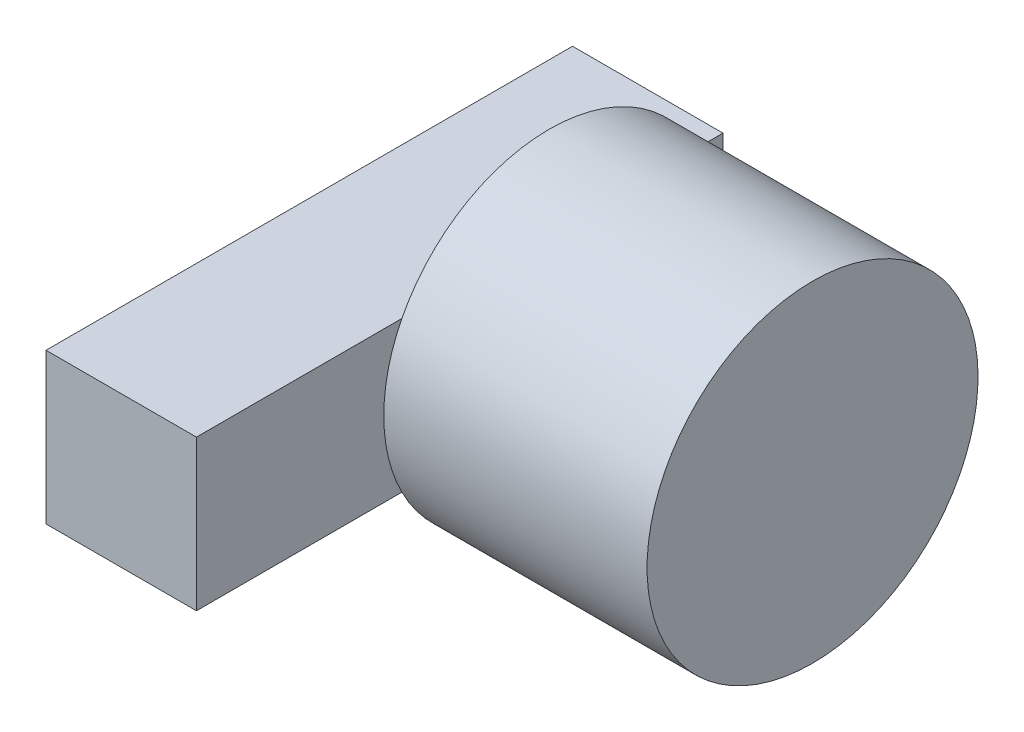
ISO-10303-21;
HEADER;
FILE_DESCRIPTION(('STEP AP214'),'2;1');
FILE_NAME('part.step','',(''),(''),'','','');
FILE_SCHEMA(('AUTOMOTIVE_DESIGN { 1 0 10303 214 1 1 1 1 }'));
ENDSEC;
DATA;
#1=APPLICATION_CONTEXT('core data for automotive mechanical design processes');
#2=APPLICATION_PROTOCOL_DEFINITION('international standard','automotive_design',2000,#1);
#3=PRODUCT_CONTEXT('',#1,'mechanical');
#4=PRODUCT('Part','Part','',(#3));
#5=PRODUCT_RELATED_PRODUCT_CATEGORY('part','',(#4));
#6=PRODUCT_DEFINITION_FORMATION('','',#4);
#7=PRODUCT_DEFINITION_CONTEXT('part definition',#1,'design');
#8=PRODUCT_DEFINITION('design','',#6,#7);
#9=PRODUCT_DEFINITION_SHAPE('','',#8);
#10=(LENGTH_UNIT() NAMED_UNIT(*) SI_UNIT(.MILLI.,.METRE.));
#11=(NAMED_UNIT(*) PLANE_ANGLE_UNIT() SI_UNIT($,.RADIAN.));
#12=(NAMED_UNIT(*) SI_UNIT($,.STERADIAN.) SOLID_ANGLE_UNIT());
#13=UNCERTAINTY_MEASURE_WITH_UNIT(LENGTH_MEASURE(1.E-05),#10,'distance_accuracy_value','');
#14=(GEOMETRIC_REPRESENTATION_CONTEXT(3) GLOBAL_UNCERTAINTY_ASSIGNED_CONTEXT((#13)) GLOBAL_UNIT_ASSIGNED_CONTEXT((#10,
#11,#12)) REPRESENTATION_CONTEXT('',''));
#15=CARTESIAN_POINT('',(0.,0.,0.));
#16=DIRECTION('',(0.,0.,1.));
#17=DIRECTION('',(1.,0.,0.));
#18=AXIS2_PLACEMENT_3D('',#15,#16,#17);
#19=CARTESIAN_POINT('',(10.,10.,70.));
#20=DIRECTION('',(-1.,0.,0.));
#21=DIRECTION('',(0.,-1.,0.));
#22=AXIS2_PLACEMENT_3D('',#19,#20,#21);
#23=PLANE('',#22);
#24=CARTESIAN_POINT('',(10.,0.,23.0922210547568));
#25=DIRECTION('',(1.,0.,0.));
#26=DIRECTION('',(0.,1.,0.));
#27=AXIS2_PLACEMENT_3D('',#24,#25,#26);
#28=CIRCLE('',#27,22.);
#29=CARTESIAN_POINT('',(10.,10.,42.6881389970223));
#30=VERTEX_POINT('',#29);
#31=CARTESIAN_POINT('',(10.,-10.,42.6881389970223));
#32=VERTEX_POINT('',#31);
#33=EDGE_CURVE('E52',#30,#32,#28,.T.);
#34=ORIENTED_EDGE('',*,*,#33,.F.);
#35=DIRECTION('',(0.,0.,-1.));
#36=VECTOR('',#35,1.);
#37=CARTESIAN_POINT('',(10.,10.,70.));
#38=LINE('',#37,#36);
#39=CARTESIAN_POINT('',(10.,10.,70.));
#40=VERTEX_POINT('',#39);
#41=EDGE_CURVE('E114',#40,#30,#38,.T.);
#42=ORIENTED_EDGE('',*,*,#41,.F.);
#43=DIRECTION('',(0.,1.,0.));
#44=VECTOR('',#43,1.);
#45=CARTESIAN_POINT('',(10.,10.,70.));
#46=LINE('',#45,#44);
#47=CARTESIAN_POINT('',(10.,-10.,70.));
#48=VERTEX_POINT('',#47);
#49=EDGE_CURVE('E150',#48,#40,#46,.T.);
#50=ORIENTED_EDGE('',*,*,#49,.F.);
#51=DIRECTION('',(0.,0.,-1.));
#52=VECTOR('',#51,1.);
#53=CARTESIAN_POINT('',(10.,-10.,70.));
#54=LINE('',#53,#52);
#55=EDGE_CURVE('E171',#48,#32,#54,.T.);
#56=ORIENTED_EDGE('',*,*,#55,.T.);
#57=EDGE_LOOP('',(#34,#42,#50,#56));
#58=FACE_BOUND('',#57,.T.);
#59=ADVANCED_FACE('F41',(#58),#23,.F.);
#60=CARTESIAN_POINT('',(-10.,10.,70.));
#61=DIRECTION('',(1.,0.,0.));
#62=DIRECTION('',(0.,1.,0.));
#63=AXIS2_PLACEMENT_3D('',#60,#61,#62);
#64=PLANE('',#63);
#65=DIRECTION('',(0.,-1.,0.));
#66=VECTOR('',#65,1.);
#67=CARTESIAN_POINT('',(-10.,10.,0.));
#68=LINE('',#67,#66);
#69=CARTESIAN_POINT('',(-10.,10.,0.));
#70=VERTEX_POINT('',#69);
#71=CARTESIAN_POINT('',(-10.,-10.,0.));
#72=VERTEX_POINT('',#71);
#73=EDGE_CURVE('E156',#70,#72,#68,.T.);
#74=ORIENTED_EDGE('',*,*,#73,.T.);
#75=DIRECTION('',(0.,0.,-1.));
#76=VECTOR('',#75,1.);
#77=CARTESIAN_POINT('',(-10.,-10.,70.));
#78=LINE('',#77,#76);
#79=CARTESIAN_POINT('',(-10.,-10.,70.));
#80=VERTEX_POINT('',#79);
#81=EDGE_CURVE('E45',#80,#72,#78,.T.);
#82=ORIENTED_EDGE('',*,*,#81,.F.);
#83=DIRECTION('',(0.,-1.,0.));
#84=VECTOR('',#83,1.);
#85=CARTESIAN_POINT('',(-10.,10.,70.));
#86=LINE('',#85,#84);
#87=CARTESIAN_POINT('',(-10.,10.,70.));
#88=VERTEX_POINT('',#87);
#89=EDGE_CURVE('E142',#88,#80,#86,.T.);
#90=ORIENTED_EDGE('',*,*,#89,.F.);
#91=DIRECTION('',(0.,0.,-1.));
#92=VECTOR('',#91,1.);
#93=CARTESIAN_POINT('',(-10.,10.,70.));
#94=LINE('',#93,#92);
#95=EDGE_CURVE('E125',#88,#70,#94,.T.);
#96=ORIENTED_EDGE('',*,*,#95,.T.);
#97=EDGE_LOOP('',(#74,#82,#90,#96));
#98=FACE_BOUND('',#97,.T.);
#99=ADVANCED_FACE('F43',(#98),#64,.F.);
#100=CARTESIAN_POINT('',(10.,-10.,70.));
#101=DIRECTION('',(0.,1.,0.));
#102=DIRECTION('',(-1.,0.,0.));
#103=AXIS2_PLACEMENT_3D('',#100,#101,#102);
#104=PLANE('',#103);
#105=DIRECTION('',(1.,0.,0.));
#106=VECTOR('',#105,1.);
#107=CARTESIAN_POINT('',(10.,-10.,0.));
#108=LINE('',#107,#106);
#109=CARTESIAN_POINT('',(10.,-10.,0.));
#110=VERTEX_POINT('',#109);
#111=EDGE_CURVE('E160',#72,#110,#108,.T.);
#112=ORIENTED_EDGE('',*,*,#111,.T.);
#113=CARTESIAN_POINT('',(10.,-10.,3.49630311249141));
#114=VERTEX_POINT('',#113);
#115=EDGE_CURVE('E170',#114,#110,#54,.T.);
#116=ORIENTED_EDGE('',*,*,#115,.F.);
#117=EDGE_CURVE('E71',#32,#114,#54,.T.);
#118=ORIENTED_EDGE('',*,*,#117,.F.);
#119=ORIENTED_EDGE('',*,*,#55,.F.);
#120=DIRECTION('',(1.,0.,0.));
#121=VECTOR('',#120,1.);
#122=CARTESIAN_POINT('',(10.,-10.,70.));
#123=LINE('',#122,#121);
#124=EDGE_CURVE('E146',#80,#48,#123,.T.);
#125=ORIENTED_EDGE('',*,*,#124,.F.);
#126=ORIENTED_EDGE('',*,*,#81,.T.);
#127=EDGE_LOOP('',(#112,#116,#118,#119,#125,#126));
#128=FACE_BOUND('',#127,.T.);
#129=ADVANCED_FACE('F178',(#128),#104,.F.);
#130=CARTESIAN_POINT('',(10.,10.,3.49630311249141));
#131=VERTEX_POINT('',#130);
#132=EDGE_CURVE('E11',#114,#131,#28,.T.);
#133=ORIENTED_EDGE('',*,*,#132,.F.);
#134=ORIENTED_EDGE('',*,*,#115,.T.);
#135=DIRECTION('',(0.,1.,0.));
#136=VECTOR('',#135,1.);
#137=CARTESIAN_POINT('',(10.,10.,0.));
#138=LINE('',#137,#136);
#139=CARTESIAN_POINT('',(10.,10.,0.));
#140=VERTEX_POINT('',#139);
#141=EDGE_CURVE('E122',#110,#140,#138,.T.);
#142=ORIENTED_EDGE('',*,*,#141,.T.);
#143=EDGE_CURVE('E110',#131,#140,#38,.T.);
#144=ORIENTED_EDGE('',*,*,#143,.F.);
#145=EDGE_LOOP('',(#133,#134,#142,#144));
#146=FACE_BOUND('',#145,.T.);
#147=ADVANCED_FACE('F120',(#146),#23,.F.);
#148=CARTESIAN_POINT('',(10.,10.,70.));
#149=DIRECTION('',(0.,-1.,0.));
#150=DIRECTION('',(1.,0.,0.));
#151=AXIS2_PLACEMENT_3D('',#148,#149,#150);
#152=PLANE('',#151);
#153=DIRECTION('',(-1.,0.,0.));
#154=VECTOR('',#153,1.);
#155=CARTESIAN_POINT('',(10.,10.,0.));
#156=LINE('',#155,#154);
#157=EDGE_CURVE('E147',#140,#70,#156,.T.);
#158=ORIENTED_EDGE('',*,*,#157,.T.);
#159=ORIENTED_EDGE('',*,*,#95,.F.);
#160=DIRECTION('',(-1.,0.,0.));
#161=VECTOR('',#160,1.);
#162=CARTESIAN_POINT('',(10.,10.,70.));
#163=LINE('',#162,#161);
#164=EDGE_CURVE('E153',#40,#88,#163,.T.);
#165=ORIENTED_EDGE('',*,*,#164,.F.);
#166=ORIENTED_EDGE('',*,*,#41,.T.);
#167=EDGE_CURVE('E108',#30,#131,#38,.T.);
#168=ORIENTED_EDGE('',*,*,#167,.T.);
#169=ORIENTED_EDGE('',*,*,#143,.T.);
#170=EDGE_LOOP('',(#158,#159,#165,#166,#168,#169));
#171=FACE_BOUND('',#170,.T.);
#172=ADVANCED_FACE('F109',(#171),#152,.F.);
#173=CARTESIAN_POINT('',(0.,0.,70.));
#174=DIRECTION('',(0.,0.,-1.));
#175=DIRECTION('',(-1.,0.,0.));
#176=AXIS2_PLACEMENT_3D('',#173,#174,#175);
#177=PLANE('',#176);
#178=ORIENTED_EDGE('',*,*,#89,.T.);
#179=ORIENTED_EDGE('',*,*,#124,.T.);
#180=ORIENTED_EDGE('',*,*,#49,.T.);
#181=ORIENTED_EDGE('',*,*,#164,.T.);
#182=EDGE_LOOP('',(#178,#179,#180,#181));
#183=FACE_BOUND('',#182,.T.);
#184=ADVANCED_FACE('F187',(#183),#177,.F.);
#185=CARTESIAN_POINT('',(0.,0.,0.));
#186=DIRECTION('',(0.,0.,-1.));
#187=DIRECTION('',(-1.,0.,0.));
#188=AXIS2_PLACEMENT_3D('',#185,#186,#187);
#189=PLANE('',#188);
#190=ORIENTED_EDGE('',*,*,#73,.F.);
#191=ORIENTED_EDGE('',*,*,#157,.F.);
#192=ORIENTED_EDGE('',*,*,#141,.F.);
#193=ORIENTED_EDGE('',*,*,#111,.F.);
#194=EDGE_LOOP('',(#190,#191,#192,#193));
#195=FACE_BOUND('',#194,.T.);
#196=ADVANCED_FACE('F182',(#195),#189,.T.);
#197=CARTESIAN_POINT('',(10.,0.,23.0922210547568));
#198=DIRECTION('',(1.,0.,0.));
#199=DIRECTION('',(0.,1.,0.));
#200=AXIS2_PLACEMENT_3D('',#197,#198,#199);
#201=PLANE('',#200);
#202=EDGE_CURVE('E53',#32,#114,#28,.T.);
#203=ORIENTED_EDGE('',*,*,#202,.F.);
#204=ORIENTED_EDGE('',*,*,#117,.T.);
#205=EDGE_LOOP('',(#203,#204));
#206=FACE_BOUND('',#205,.T.);
#207=ADVANCED_FACE('F223',(#206),#201,.F.);
#208=CARTESIAN_POINT('',(45.,0.,23.0922210547568));
#209=DIRECTION('',(-1.,0.,0.));
#210=DIRECTION('',(0.,-1.,0.));
#211=AXIS2_PLACEMENT_3D('',#208,#209,#210);
#212=CYLINDRICAL_SURFACE('',#211,22.);
#213=CARTESIAN_POINT('',(45.,0.,23.0922210547568));
#214=DIRECTION('',(1.,0.,0.));
#215=DIRECTION('',(0.,1.,0.));
#216=AXIS2_PLACEMENT_3D('',#213,#214,#215);
#217=CIRCLE('',#216,22.);
#218=CARTESIAN_POINT('',(45.,22.,23.0922210547568));
#219=VERTEX_POINT('',#218);
#220=EDGE_CURVE('E139',#219,#219,#217,.T.);
#221=ORIENTED_EDGE('',*,*,#220,.F.);
#222=EDGE_LOOP('',(#221));
#223=FACE_BOUND('',#222,.T.);
#224=ORIENTED_EDGE('',*,*,#33,.T.);
#225=ORIENTED_EDGE('',*,*,#202,.T.);
#226=ORIENTED_EDGE('',*,*,#132,.T.);
#227=EDGE_CURVE('E126',#131,#30,#28,.T.);
#228=ORIENTED_EDGE('',*,*,#227,.T.);
#229=EDGE_LOOP('',(#224,#225,#226,#228));
#230=FACE_BOUND('',#229,.T.);
#231=ADVANCED_FACE('F132',(#223,#230),#212,.T.);
#232=CARTESIAN_POINT('',(45.,0.,23.0922210547568));
#233=DIRECTION('',(1.,0.,0.));
#234=DIRECTION('',(0.,1.,0.));
#235=AXIS2_PLACEMENT_3D('',#232,#233,#234);
#236=PLANE('',#235);
#237=ORIENTED_EDGE('',*,*,#220,.T.);
#238=EDGE_LOOP('',(#237));
#239=FACE_BOUND('',#238,.T.);
#240=ADVANCED_FACE('F257',(#239),#236,.T.);
#241=ORIENTED_EDGE('',*,*,#167,.F.);
#242=ORIENTED_EDGE('',*,*,#227,.F.);
#243=EDGE_LOOP('',(#241,#242));
#244=FACE_BOUND('',#243,.T.);
#245=ADVANCED_FACE('F127',(#244),#201,.F.);
#246=CLOSED_SHELL('',(#59,#99,#129,#147,#172,#184,#196,#207,#231,#240,#245));
#247=MANIFOLD_SOLID_BREP('B2',#246);
#248=ADVANCED_BREP_SHAPE_REPRESENTATION('',(#18,#247),#14);
#249=SHAPE_DEFINITION_REPRESENTATION(#9,#248);
ENDSEC;
END-ISO-10303-21;
